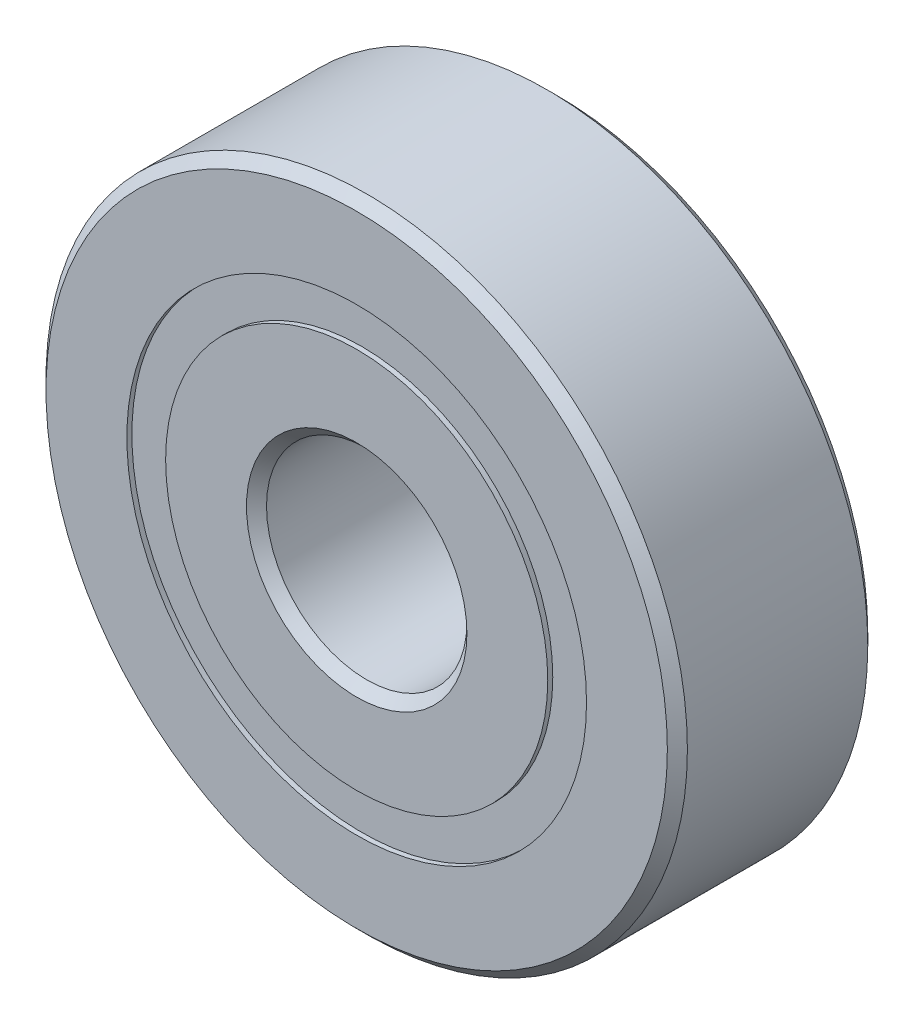
ISO-10303-21;
HEADER;
FILE_DESCRIPTION(('STEP AP214'),'2;1');
FILE_NAME('part.step','',(''),(''),'','','');
FILE_SCHEMA(('AUTOMOTIVE_DESIGN { 1 0 10303 214 1 1 1 1 }'));
ENDSEC;
DATA;
#1=APPLICATION_CONTEXT('core data for automotive mechanical design processes');
#2=APPLICATION_PROTOCOL_DEFINITION('international standard','automotive_design',2000,#1);
#3=PRODUCT_CONTEXT('',#1,'mechanical');
#4=PRODUCT('Part','Part','',(#3));
#5=PRODUCT_RELATED_PRODUCT_CATEGORY('part','',(#4));
#6=PRODUCT_DEFINITION_FORMATION('','',#4);
#7=PRODUCT_DEFINITION_CONTEXT('part definition',#1,'design');
#8=PRODUCT_DEFINITION('design','',#6,#7);
#9=PRODUCT_DEFINITION_SHAPE('','',#8);
#10=(LENGTH_UNIT() NAMED_UNIT(*) SI_UNIT(.MILLI.,.METRE.));
#11=(NAMED_UNIT(*) PLANE_ANGLE_UNIT() SI_UNIT($,.RADIAN.));
#12=(NAMED_UNIT(*) SI_UNIT($,.STERADIAN.) SOLID_ANGLE_UNIT());
#13=UNCERTAINTY_MEASURE_WITH_UNIT(LENGTH_MEASURE(1.E-05),#10,'distance_accuracy_value','');
#14=(GEOMETRIC_REPRESENTATION_CONTEXT(3) GLOBAL_UNCERTAINTY_ASSIGNED_CONTEXT((#13)) GLOBAL_UNIT_ASSIGNED_CONTEXT((#10,
#11,#12)) REPRESENTATION_CONTEXT('',''));
#15=CARTESIAN_POINT('',(0.,0.,0.));
#16=DIRECTION('',(0.,0.,1.));
#17=DIRECTION('',(1.,0.,0.));
#18=AXIS2_PLACEMENT_3D('',#15,#16,#17);
#19=CARTESIAN_POINT('',(0.,5.73351648351649,-2.375));
#20=DIRECTION('',(0.,0.,1.));
#21=DIRECTION('',(1.,0.,0.));
#22=AXIS2_PLACEMENT_3D('',#19,#20,#21);
#23=PLANE('',#22);
#24=CARTESIAN_POINT('',(0.,0.,-2.375));
#25=DIRECTION('',(0.,0.,1.));
#26=DIRECTION('',(1.,0.,0.));
#27=AXIS2_PLACEMENT_3D('',#24,#25,#26);
#28=CIRCLE('',#27,5.73351648351649);
#29=CARTESIAN_POINT('',(5.73351648351649,0.,-2.375));
#30=VERTEX_POINT('',#29);
#31=EDGE_CURVE('E59',#30,#30,#28,.T.);
#32=ORIENTED_EDGE('',*,*,#31,.F.);
#33=EDGE_LOOP('',(#32));
#34=FACE_BOUND('',#33,.T.);
#35=CARTESIAN_POINT('',(0.,0.,-2.375));
#36=DIRECTION('',(0.,0.,1.));
#37=DIRECTION('',(1.,0.,0.));
#38=AXIS2_PLACEMENT_3D('',#35,#36,#37);
#39=CIRCLE('',#38,4.76648351648352);
#40=CARTESIAN_POINT('',(4.76648351648352,0.,-2.375));
#41=VERTEX_POINT('',#40);
#42=EDGE_CURVE('E11',#41,#41,#39,.T.);
#43=ORIENTED_EDGE('',*,*,#42,.T.);
#44=EDGE_LOOP('',(#43));
#45=FACE_BOUND('',#44,.T.);
#46=ADVANCED_FACE('F45',(#34,#45),#23,.F.);
#47=CARTESIAN_POINT('',(0.,0.,2.5));
#48=DIRECTION('',(0.,0.,1.));
#49=DIRECTION('',(1.,0.,0.));
#50=AXIS2_PLACEMENT_3D('',#47,#48,#49);
#51=CYLINDRICAL_SURFACE('',#50,4.76648351648352);
#52=ORIENTED_EDGE('',*,*,#42,.F.);
#53=EDGE_LOOP('',(#52));
#54=FACE_BOUND('',#53,.T.);
#55=CARTESIAN_POINT('',(0.,0.,-1.21175743903915));
#56=DIRECTION('',(0.,0.,1.));
#57=DIRECTION('',(1.,0.,0.));
#58=AXIS2_PLACEMENT_3D('',#55,#56,#57);
#59=CIRCLE('',#58,4.76648351648352);
#60=CARTESIAN_POINT('',(4.76648351648352,0.,-1.21175743903915));
#61=VERTEX_POINT('',#60);
#62=EDGE_CURVE('E51',#61,#61,#59,.T.);
#63=ORIENTED_EDGE('',*,*,#62,.T.);
#64=EDGE_LOOP('',(#63));
#65=FACE_BOUND('',#64,.T.);
#66=ADVANCED_FACE('F68',(#54,#65),#51,.F.);
#67=CARTESIAN_POINT('',(0.,5.73351648351649,-1.21175743903915));
#68=DIRECTION('',(0.,0.,-1.));
#69=DIRECTION('',(-1.,0.,0.));
#70=AXIS2_PLACEMENT_3D('',#67,#68,#69);
#71=PLANE('',#70);
#72=ORIENTED_EDGE('',*,*,#62,.F.);
#73=EDGE_LOOP('',(#72));
#74=FACE_BOUND('',#73,.T.);
#75=CARTESIAN_POINT('',(0.,0.,-1.21175743903915));
#76=DIRECTION('',(0.,0.,1.));
#77=DIRECTION('',(1.,0.,0.));
#78=AXIS2_PLACEMENT_3D('',#75,#76,#77);
#79=CIRCLE('',#78,5.73351648351649);
#80=CARTESIAN_POINT('',(5.73351648351649,0.,-1.21175743903915));
#81=VERTEX_POINT('',#80);
#82=EDGE_CURVE('E55',#81,#81,#79,.T.);
#83=ORIENTED_EDGE('',*,*,#82,.T.);
#84=EDGE_LOOP('',(#83));
#85=FACE_BOUND('',#84,.T.);
#86=ADVANCED_FACE('F72',(#74,#85),#71,.F.);
#87=CARTESIAN_POINT('',(0.,0.,2.5));
#88=DIRECTION('',(0.,0.,1.));
#89=DIRECTION('',(1.,0.,0.));
#90=AXIS2_PLACEMENT_3D('',#87,#88,#89);
#91=CYLINDRICAL_SURFACE('',#90,5.73351648351649);
#92=ORIENTED_EDGE('',*,*,#82,.F.);
#93=EDGE_LOOP('',(#92));
#94=FACE_BOUND('',#93,.T.);
#95=ORIENTED_EDGE('',*,*,#31,.T.);
#96=EDGE_LOOP('',(#95));
#97=FACE_BOUND('',#96,.T.);
#98=ADVANCED_FACE('F65',(#94,#97),#91,.T.);
#99=CLOSED_SHELL('',(#46,#66,#86,#98));
#100=MANIFOLD_SOLID_BREP('B2',#99);
#101=CARTESIAN_POINT('',(0.,5.73351648351648,2.375));
#102=DIRECTION('',(0.,0.,-1.));
#103=DIRECTION('',(-1.,0.,0.));
#104=AXIS2_PLACEMENT_3D('',#101,#102,#103);
#105=PLANE('',#104);
#106=CARTESIAN_POINT('',(0.,0.,2.375));
#107=DIRECTION('',(0.,0.,1.));
#108=DIRECTION('',(1.,0.,0.));
#109=AXIS2_PLACEMENT_3D('',#106,#107,#108);
#110=CIRCLE('',#109,4.76648351648352);
#111=CARTESIAN_POINT('',(4.76648351648352,0.,2.375));
#112=VERTEX_POINT('',#111);
#113=EDGE_CURVE('E44',#112,#112,#110,.T.);
#114=ORIENTED_EDGE('',*,*,#113,.F.);
#115=EDGE_LOOP('',(#114));
#116=FACE_BOUND('',#115,.T.);
#117=CARTESIAN_POINT('',(0.,0.,2.375));
#118=DIRECTION('',(0.,0.,1.));
#119=DIRECTION('',(1.,0.,0.));
#120=AXIS2_PLACEMENT_3D('',#117,#118,#119);
#121=CIRCLE('',#120,5.73351648351648);
#122=CARTESIAN_POINT('',(5.73351648351648,0.,2.375));
#123=VERTEX_POINT('',#122);
#124=EDGE_CURVE('E126',#123,#123,#121,.T.);
#125=ORIENTED_EDGE('',*,*,#124,.T.);
#126=EDGE_LOOP('',(#125));
#127=FACE_BOUND('',#126,.T.);
#128=ADVANCED_FACE('F112',(#116,#127),#105,.F.);
#129=CARTESIAN_POINT('',(0.,0.,2.5));
#130=DIRECTION('',(0.,0.,1.));
#131=DIRECTION('',(1.,0.,0.));
#132=AXIS2_PLACEMENT_3D('',#129,#130,#131);
#133=CYLINDRICAL_SURFACE('',#132,4.76648351648352);
#134=CARTESIAN_POINT('',(0.,0.,1.21175743903915));
#135=DIRECTION('',(0.,0.,1.));
#136=DIRECTION('',(1.,0.,0.));
#137=AXIS2_PLACEMENT_3D('',#134,#135,#136);
#138=CIRCLE('',#137,4.76648351648352);
#139=CARTESIAN_POINT('',(4.76648351648352,0.,1.21175743903915));
#140=VERTEX_POINT('',#139);
#141=EDGE_CURVE('E118',#140,#140,#138,.T.);
#142=ORIENTED_EDGE('',*,*,#141,.F.);
#143=EDGE_LOOP('',(#142));
#144=FACE_BOUND('',#143,.T.);
#145=ORIENTED_EDGE('',*,*,#113,.T.);
#146=EDGE_LOOP('',(#145));
#147=FACE_BOUND('',#146,.T.);
#148=ADVANCED_FACE('F141',(#144,#147),#133,.F.);
#149=CARTESIAN_POINT('',(0.,5.73351648351648,1.21175743903915));
#150=DIRECTION('',(0.,0.,1.));
#151=DIRECTION('',(1.,0.,0.));
#152=AXIS2_PLACEMENT_3D('',#149,#150,#151);
#153=PLANE('',#152);
#154=CARTESIAN_POINT('',(0.,0.,1.21175743903915));
#155=DIRECTION('',(0.,0.,1.));
#156=DIRECTION('',(1.,0.,0.));
#157=AXIS2_PLACEMENT_3D('',#154,#155,#156);
#158=CIRCLE('',#157,5.73351648351648);
#159=CARTESIAN_POINT('',(5.73351648351648,0.,1.21175743903915));
#160=VERTEX_POINT('',#159);
#161=EDGE_CURVE('E122',#160,#160,#158,.T.);
#162=ORIENTED_EDGE('',*,*,#161,.F.);
#163=EDGE_LOOP('',(#162));
#164=FACE_BOUND('',#163,.T.);
#165=ORIENTED_EDGE('',*,*,#141,.T.);
#166=EDGE_LOOP('',(#165));
#167=FACE_BOUND('',#166,.T.);
#168=ADVANCED_FACE('F136',(#164,#167),#153,.F.);
#169=CARTESIAN_POINT('',(0.,0.,2.5));
#170=DIRECTION('',(0.,0.,1.));
#171=DIRECTION('',(1.,0.,0.));
#172=AXIS2_PLACEMENT_3D('',#169,#170,#171);
#173=CYLINDRICAL_SURFACE('',#172,5.73351648351648);
#174=ORIENTED_EDGE('',*,*,#124,.F.);
#175=EDGE_LOOP('',(#174));
#176=FACE_BOUND('',#175,.T.);
#177=ORIENTED_EDGE('',*,*,#161,.T.);
#178=EDGE_LOOP('',(#177));
#179=FACE_BOUND('',#178,.T.);
#180=ADVANCED_FACE('F133',(#176,#179),#173,.T.);
#181=CLOSED_SHELL('',(#128,#148,#168,#180));
#182=MANIFOLD_SOLID_BREP('B6',#181);
#183=CARTESIAN_POINT('',(-2.62499999999994,4.54663336986834,0.));
#184=DIRECTION('',(0.,0.,1.));
#185=DIRECTION('',(-0.499999999999989,0.866025403784445,0.));
#186=AXIS2_PLACEMENT_3D('',#183,#184,#185);
#187=SPHERICAL_SURFACE('',#186,1.21175743903915);
#188=CARTESIAN_POINT('',(-2.62499999999994,4.54663336986834,1.21175743903915));
#189=VERTEX_POINT('',#188);
#190=VERTEX_LOOP('',#189);
#191=FACE_BOUND('',#190,.T.);
#192=ADVANCED_FACE('F179',(#191),#187,.T.);
#193=CLOSED_SHELL('',(#192));
#194=MANIFOLD_SOLID_BREP('B39',#193);
#195=CARTESIAN_POINT('',(-4.54663336986827,2.62500000000005,0.));
#196=DIRECTION('',(0.,0.,1.));
#197=DIRECTION('',(-0.866025403784433,0.50000000000001,0.));
#198=AXIS2_PLACEMENT_3D('',#195,#196,#197);
#199=SPHERICAL_SURFACE('',#198,1.21175743903915);
#200=CARTESIAN_POINT('',(-4.54663336986827,2.62500000000005,1.21175743903915));
#201=VERTEX_POINT('',#200);
#202=VERTEX_LOOP('',#201);
#203=FACE_BOUND('',#202,.T.);
#204=ADVANCED_FACE('F199',(#203),#199,.T.);
#205=CLOSED_SHELL('',(#204));
#206=MANIFOLD_SOLID_BREP('B108',#205);
#207=CARTESIAN_POINT('',(-5.25,0.,0.));
#208=DIRECTION('',(0.,0.,1.));
#209=DIRECTION('',(-1.,0.,0.));
#210=AXIS2_PLACEMENT_3D('',#207,#208,#209);
#211=SPHERICAL_SURFACE('',#210,1.21175743903915);
#212=CARTESIAN_POINT('',(-5.25,0.,1.21175743903915));
#213=VERTEX_POINT('',#212);
#214=VERTEX_LOOP('',#213);
#215=FACE_BOUND('',#214,.T.);
#216=ADVANCED_FACE('F219',(#215),#211,.T.);
#217=CLOSED_SHELL('',(#216));
#218=MANIFOLD_SOLID_BREP('B175',#217);
#219=CARTESIAN_POINT('',(-4.54663336986833,-2.62499999999996,0.));
#220=DIRECTION('',(0.,0.,1.));
#221=DIRECTION('',(-0.866025403784443,-0.499999999999992,0.));
#222=AXIS2_PLACEMENT_3D('',#219,#220,#221);
#223=SPHERICAL_SURFACE('',#222,1.21175743903915);
#224=CARTESIAN_POINT('',(-4.54663336986833,-2.62499999999996,1.21175743903915));
#225=VERTEX_POINT('',#224);
#226=VERTEX_LOOP('',#225);
#227=FACE_BOUND('',#226,.T.);
#228=ADVANCED_FACE('F239',(#227),#223,.T.);
#229=CLOSED_SHELL('',(#228));
#230=MANIFOLD_SOLID_BREP('B195',#229);
#231=CARTESIAN_POINT('',(-2.62500000000004,-4.54663336986828,0.));
#232=DIRECTION('',(0.,0.,1.));
#233=DIRECTION('',(-0.500000000000007,-0.866025403784435,0.));
#234=AXIS2_PLACEMENT_3D('',#231,#232,#233);
#235=SPHERICAL_SURFACE('',#234,1.21175743903915);
#236=CARTESIAN_POINT('',(-2.62500000000004,-4.54663336986828,1.21175743903915));
#237=VERTEX_POINT('',#236);
#238=VERTEX_LOOP('',#237);
#239=FACE_BOUND('',#238,.T.);
#240=ADVANCED_FACE('F259',(#239),#235,.T.);
#241=CLOSED_SHELL('',(#240));
#242=MANIFOLD_SOLID_BREP('B215',#241);
#243=CARTESIAN_POINT('',(0.,-5.25,0.));
#244=DIRECTION('',(0.,0.,1.));
#245=DIRECTION('',(0.,-1.,0.));
#246=AXIS2_PLACEMENT_3D('',#243,#244,#245);
#247=SPHERICAL_SURFACE('',#246,1.21175743903915);
#248=CARTESIAN_POINT('',(0.,-5.25,1.21175743903915));
#249=VERTEX_POINT('',#248);
#250=VERTEX_LOOP('',#249);
#251=FACE_BOUND('',#250,.T.);
#252=ADVANCED_FACE('F279',(#251),#247,.T.);
#253=CLOSED_SHELL('',(#252));
#254=MANIFOLD_SOLID_BREP('B235',#253);
#255=CARTESIAN_POINT('',(2.62499999999997,-4.54663336986832,0.));
#256=DIRECTION('',(0.,0.,1.));
#257=DIRECTION('',(0.499999999999995,-0.866025403784442,0.));
#258=AXIS2_PLACEMENT_3D('',#255,#256,#257);
#259=SPHERICAL_SURFACE('',#258,1.21175743903915);
#260=CARTESIAN_POINT('',(2.62499999999997,-4.54663336986832,1.21175743903915));
#261=VERTEX_POINT('',#260);
#262=VERTEX_LOOP('',#261);
#263=FACE_BOUND('',#262,.T.);
#264=ADVANCED_FACE('F299',(#263),#259,.T.);
#265=CLOSED_SHELL('',(#264));
#266=MANIFOLD_SOLID_BREP('B255',#265);
#267=CARTESIAN_POINT('',(4.54663336986829,-2.62500000000002,0.));
#268=DIRECTION('',(0.,0.,1.));
#269=DIRECTION('',(0.866025403784436,-0.500000000000004,0.));
#270=AXIS2_PLACEMENT_3D('',#267,#268,#269);
#271=SPHERICAL_SURFACE('',#270,1.21175743903915);
#272=CARTESIAN_POINT('',(4.54663336986829,-2.62500000000002,1.21175743903915));
#273=VERTEX_POINT('',#272);
#274=VERTEX_LOOP('',#273);
#275=FACE_BOUND('',#274,.T.);
#276=ADVANCED_FACE('F319',(#275),#271,.T.);
#277=CLOSED_SHELL('',(#276));
#278=MANIFOLD_SOLID_BREP('B275',#277);
#279=CARTESIAN_POINT('',(5.25,0.,0.));
#280=DIRECTION('',(0.,0.,1.));
#281=DIRECTION('',(1.,0.,0.));
#282=AXIS2_PLACEMENT_3D('',#279,#280,#281);
#283=SPHERICAL_SURFACE('',#282,1.21175743903915);
#284=CARTESIAN_POINT('',(5.25,0.,1.21175743903915));
#285=VERTEX_POINT('',#284);
#286=VERTEX_LOOP('',#285);
#287=FACE_BOUND('',#286,.T.);
#288=ADVANCED_FACE('F339',(#287),#283,.T.);
#289=CLOSED_SHELL('',(#288));
#290=MANIFOLD_SOLID_BREP('B295',#289);
#291=CARTESIAN_POINT('',(4.54663336986831,2.62499999999999,0.));
#292=DIRECTION('',(0.,0.,1.));
#293=DIRECTION('',(0.86602540378444,0.499999999999998,0.));
#294=AXIS2_PLACEMENT_3D('',#291,#292,#293);
#295=SPHERICAL_SURFACE('',#294,1.21175743903915);
#296=CARTESIAN_POINT('',(4.54663336986831,2.62499999999999,1.21175743903915));
#297=VERTEX_POINT('',#296);
#298=VERTEX_LOOP('',#297);
#299=FACE_BOUND('',#298,.T.);
#300=ADVANCED_FACE('F359',(#299),#295,.T.);
#301=CLOSED_SHELL('',(#300));
#302=MANIFOLD_SOLID_BREP('B315',#301);
#303=CARTESIAN_POINT('',(2.62500000000001,4.5466333698683,0.));
#304=DIRECTION('',(0.,0.,1.));
#305=DIRECTION('',(0.500000000000001,0.866025403784438,0.));
#306=AXIS2_PLACEMENT_3D('',#303,#304,#305);
#307=SPHERICAL_SURFACE('',#306,1.21175743903915);
#308=CARTESIAN_POINT('',(2.62500000000001,4.5466333698683,1.21175743903915));
#309=VERTEX_POINT('',#308);
#310=VERTEX_LOOP('',#309);
#311=FACE_BOUND('',#310,.T.);
#312=ADVANCED_FACE('F379',(#311),#307,.T.);
#313=CLOSED_SHELL('',(#312));
#314=MANIFOLD_SOLID_BREP('B335',#313);
#315=CARTESIAN_POINT('',(0.,5.25,0.));
#316=DIRECTION('',(0.,0.,1.));
#317=DIRECTION('',(0.,1.,0.));
#318=AXIS2_PLACEMENT_3D('',#315,#316,#317);
#319=SPHERICAL_SURFACE('',#318,1.21175743903915);
#320=CARTESIAN_POINT('',(0.,5.25,1.21175743903915));
#321=VERTEX_POINT('',#320);
#322=VERTEX_LOOP('',#321);
#323=FACE_BOUND('',#322,.T.);
#324=ADVANCED_FACE('F401',(#323),#319,.T.);
#325=CLOSED_SHELL('',(#324));
#326=MANIFOLD_SOLID_BREP('B355',#325);
#327=CARTESIAN_POINT('',(0.,4.76648351648352,2.5));
#328=DIRECTION('',(0.,0.,-1.));
#329=DIRECTION('',(-1.,0.,0.));
#330=AXIS2_PLACEMENT_3D('',#327,#328,#329);
#331=PLANE('',#330);
#332=CARTESIAN_POINT('',(0.,0.,2.5));
#333=DIRECTION('',(0.,0.,1.));
#334=DIRECTION('',(1.,0.,0.));
#335=AXIS2_PLACEMENT_3D('',#332,#333,#334);
#336=CIRCLE('',#335,2.75);
#337=CARTESIAN_POINT('',(2.75,0.,2.5));
#338=VERTEX_POINT('',#337);
#339=EDGE_CURVE('E448',#338,#338,#336,.T.);
#340=ORIENTED_EDGE('',*,*,#339,.F.);
#341=EDGE_LOOP('',(#340));
#342=FACE_BOUND('',#341,.T.);
#343=CARTESIAN_POINT('',(0.,0.,2.5));
#344=DIRECTION('',(0.,0.,1.));
#345=DIRECTION('',(1.,0.,0.));
#346=AXIS2_PLACEMENT_3D('',#343,#344,#345);
#347=CIRCLE('',#346,4.76648351648352);
#348=CARTESIAN_POINT('',(4.76648351648352,0.,2.5));
#349=VERTEX_POINT('',#348);
#350=EDGE_CURVE('E400',#349,#349,#347,.T.);
#351=ORIENTED_EDGE('',*,*,#350,.T.);
#352=EDGE_LOOP('',(#351));
#353=FACE_BOUND('',#352,.T.);
#354=ADVANCED_FACE('F420',(#342,#353),#331,.F.);
#355=CARTESIAN_POINT('',(0.,0.,2.5));
#356=DIRECTION('',(0.,0.,1.));
#357=DIRECTION('',(1.,0.,0.));
#358=AXIS2_PLACEMENT_3D('',#355,#356,#357);
#359=CYLINDRICAL_SURFACE('',#358,4.76648351648352);
#360=ORIENTED_EDGE('',*,*,#350,.F.);
#361=EDGE_LOOP('',(#360));
#362=FACE_BOUND('',#361,.T.);
#363=CARTESIAN_POINT('',(0.,0.,1.11111111111111));
#364=DIRECTION('',(0.,0.,1.));
#365=DIRECTION('',(1.,0.,0.));
#366=AXIS2_PLACEMENT_3D('',#363,#364,#365);
#367=CIRCLE('',#366,4.76648351648352);
#368=CARTESIAN_POINT('',(4.76648351648352,0.,1.11111111111111));
#369=VERTEX_POINT('',#368);
#370=EDGE_CURVE('E426',#369,#369,#367,.T.);
#371=ORIENTED_EDGE('',*,*,#370,.T.);
#372=EDGE_LOOP('',(#371));
#373=FACE_BOUND('',#372,.T.);
#374=ADVANCED_FACE('F455',(#362,#373),#359,.T.);
#375=CARTESIAN_POINT('',(0.,0.,0.));
#376=DIRECTION('',(0.,0.,1.));
#377=DIRECTION('',(1.,0.,0.));
#378=AXIS2_PLACEMENT_3D('',#375,#376,#377);
#379=TOROIDAL_SURFACE('',#378,5.25,1.21175743903915);
#380=ORIENTED_EDGE('',*,*,#370,.F.);
#381=EDGE_LOOP('',(#380));
#382=FACE_BOUND('',#381,.T.);
#383=CARTESIAN_POINT('',(0.,0.,-1.11111111111111));
#384=DIRECTION('',(0.,0.,1.));
#385=DIRECTION('',(1.,0.,0.));
#386=AXIS2_PLACEMENT_3D('',#383,#384,#385);
#387=CIRCLE('',#386,4.76648351648352);
#388=CARTESIAN_POINT('',(4.76648351648352,0.,-1.11111111111111));
#389=VERTEX_POINT('',#388);
#390=EDGE_CURVE('E430',#389,#389,#387,.T.);
#391=ORIENTED_EDGE('',*,*,#390,.T.);
#392=EDGE_LOOP('',(#391));
#393=FACE_BOUND('',#392,.T.);
#394=ADVANCED_FACE('F459',(#382,#393),#379,.F.);
#395=CARTESIAN_POINT('',(0.,0.,2.5));
#396=DIRECTION('',(0.,0.,1.));
#397=DIRECTION('',(1.,0.,0.));
#398=AXIS2_PLACEMENT_3D('',#395,#396,#397);
#399=CYLINDRICAL_SURFACE('',#398,4.76648351648352);
#400=ORIENTED_EDGE('',*,*,#390,.F.);
#401=EDGE_LOOP('',(#400));
#402=FACE_BOUND('',#401,.T.);
#403=CARTESIAN_POINT('',(0.,0.,-2.5));
#404=DIRECTION('',(0.,0.,1.));
#405=DIRECTION('',(1.,0.,0.));
#406=AXIS2_PLACEMENT_3D('',#403,#404,#405);
#407=CIRCLE('',#406,4.76648351648352);
#408=CARTESIAN_POINT('',(4.76648351648352,0.,-2.5));
#409=VERTEX_POINT('',#408);
#410=EDGE_CURVE('E434',#409,#409,#407,.T.);
#411=ORIENTED_EDGE('',*,*,#410,.T.);
#412=EDGE_LOOP('',(#411));
#413=FACE_BOUND('',#412,.T.);
#414=ADVANCED_FACE('F464',(#402,#413),#399,.T.);
#415=CARTESIAN_POINT('',(0.,2.75,-2.5));
#416=DIRECTION('',(0.,0.,1.));
#417=DIRECTION('',(1.,0.,0.));
#418=AXIS2_PLACEMENT_3D('',#415,#416,#417);
#419=PLANE('',#418);
#420=ORIENTED_EDGE('',*,*,#410,.F.);
#421=EDGE_LOOP('',(#420));
#422=FACE_BOUND('',#421,.T.);
#423=CARTESIAN_POINT('',(0.,0.,-2.5));
#424=DIRECTION('',(0.,0.,1.));
#425=DIRECTION('',(1.,0.,0.));
#426=AXIS2_PLACEMENT_3D('',#423,#424,#425);
#427=CIRCLE('',#426,2.75);
#428=CARTESIAN_POINT('',(2.75,0.,-2.5));
#429=VERTEX_POINT('',#428);
#430=EDGE_CURVE('E439',#429,#429,#427,.T.);
#431=ORIENTED_EDGE('',*,*,#430,.T.);
#432=EDGE_LOOP('',(#431));
#433=FACE_BOUND('',#432,.T.);
#434=ADVANCED_FACE('F470',(#422,#433),#419,.F.);
#435=CARTESIAN_POINT('',(0.,0.,-2.25));
#436=DIRECTION('',(0.,0.,-1.));
#437=DIRECTION('',(-1.,0.,0.));
#438=AXIS2_PLACEMENT_3D('',#435,#436,#437);
#439=CONICAL_SURFACE('',#438,2.5,0.785398163397447);
#440=ORIENTED_EDGE('',*,*,#430,.F.);
#441=EDGE_LOOP('',(#440));
#442=FACE_BOUND('',#441,.T.);
#443=CARTESIAN_POINT('',(0.,0.,-2.25));
#444=DIRECTION('',(0.,0.,1.));
#445=DIRECTION('',(1.,0.,0.));
#446=AXIS2_PLACEMENT_3D('',#443,#444,#445);
#447=CIRCLE('',#446,2.5);
#448=CARTESIAN_POINT('',(2.5,0.,-2.25));
#449=VERTEX_POINT('',#448);
#450=EDGE_CURVE('E442',#449,#449,#447,.T.);
#451=ORIENTED_EDGE('',*,*,#450,.T.);
#452=EDGE_LOOP('',(#451));
#453=FACE_BOUND('',#452,.T.);
#454=ADVANCED_FACE('F474',(#442,#453),#439,.F.);
#455=CARTESIAN_POINT('',(0.,0.,2.5));
#456=DIRECTION('',(0.,0.,1.));
#457=DIRECTION('',(1.,0.,0.));
#458=AXIS2_PLACEMENT_3D('',#455,#456,#457);
#459=CYLINDRICAL_SURFACE('',#458,2.5);
#460=ORIENTED_EDGE('',*,*,#450,.F.);
#461=EDGE_LOOP('',(#460));
#462=FACE_BOUND('',#461,.T.);
#463=CARTESIAN_POINT('',(0.,0.,2.25));
#464=DIRECTION('',(0.,0.,1.));
#465=DIRECTION('',(1.,0.,0.));
#466=AXIS2_PLACEMENT_3D('',#463,#464,#465);
#467=CIRCLE('',#466,2.5);
#468=CARTESIAN_POINT('',(2.5,0.,2.25));
#469=VERTEX_POINT('',#468);
#470=EDGE_CURVE('E445',#469,#469,#467,.T.);
#471=ORIENTED_EDGE('',*,*,#470,.T.);
#472=EDGE_LOOP('',(#471));
#473=FACE_BOUND('',#472,.T.);
#474=ADVANCED_FACE('F478',(#462,#473),#459,.F.);
#475=CARTESIAN_POINT('',(0.,0.,2.5));
#476=DIRECTION('',(0.,0.,1.));
#477=DIRECTION('',(1.,0.,0.));
#478=AXIS2_PLACEMENT_3D('',#475,#476,#477);
#479=CONICAL_SURFACE('',#478,2.75,0.785398163397452);
#480=ORIENTED_EDGE('',*,*,#470,.F.);
#481=EDGE_LOOP('',(#480));
#482=FACE_BOUND('',#481,.T.);
#483=ORIENTED_EDGE('',*,*,#339,.T.);
#484=EDGE_LOOP('',(#483));
#485=FACE_BOUND('',#484,.T.);
#486=ADVANCED_FACE('F452',(#482,#485),#479,.F.);
#487=CLOSED_SHELL('',(#354,#374,#394,#414,#434,#454,#474,#486));
#488=MANIFOLD_SOLID_BREP('B375',#487);
#489=CARTESIAN_POINT('',(0.,0.,2.25));
#490=DIRECTION('',(0.,0.,-1.));
#491=DIRECTION('',(-1.,0.,0.));
#492=AXIS2_PLACEMENT_3D('',#489,#490,#491);
#493=CONICAL_SURFACE('',#492,8.,0.785398163397448);
#494=CARTESIAN_POINT('',(0.,0.,2.5));
#495=DIRECTION('',(0.,0.,1.));
#496=DIRECTION('',(1.,0.,0.));
#497=AXIS2_PLACEMENT_3D('',#494,#495,#496);
#498=CIRCLE('',#497,7.75);
#499=CARTESIAN_POINT('',(7.75,0.,2.5));
#500=VERTEX_POINT('',#499);
#501=EDGE_CURVE('E569',#500,#500,#498,.T.);
#502=ORIENTED_EDGE('',*,*,#501,.F.);
#503=EDGE_LOOP('',(#502));
#504=FACE_BOUND('',#503,.T.);
#505=CARTESIAN_POINT('',(0.,0.,2.25));
#506=DIRECTION('',(0.,0.,1.));
#507=DIRECTION('',(1.,0.,0.));
#508=AXIS2_PLACEMENT_3D('',#505,#506,#507);
#509=CIRCLE('',#508,8.);
#510=CARTESIAN_POINT('',(8.,0.,2.25));
#511=VERTEX_POINT('',#510);
#512=EDGE_CURVE('E419',#511,#511,#509,.T.);
#513=ORIENTED_EDGE('',*,*,#512,.T.);
#514=EDGE_LOOP('',(#513));
#515=FACE_BOUND('',#514,.T.);
#516=ADVANCED_FACE('F541',(#504,#515),#493,.T.);
#517=CARTESIAN_POINT('',(0.,0.,2.5));
#518=DIRECTION('',(0.,0.,1.));
#519=DIRECTION('',(1.,0.,0.));
#520=AXIS2_PLACEMENT_3D('',#517,#518,#519);
#521=CYLINDRICAL_SURFACE('',#520,8.);
#522=ORIENTED_EDGE('',*,*,#512,.F.);
#523=EDGE_LOOP('',(#522));
#524=FACE_BOUND('',#523,.T.);
#525=CARTESIAN_POINT('',(0.,0.,-2.25));
#526=DIRECTION('',(0.,0.,1.));
#527=DIRECTION('',(1.,0.,0.));
#528=AXIS2_PLACEMENT_3D('',#525,#526,#527);
#529=CIRCLE('',#528,8.);
#530=CARTESIAN_POINT('',(8.,0.,-2.25));
#531=VERTEX_POINT('',#530);
#532=EDGE_CURVE('E547',#531,#531,#529,.T.);
#533=ORIENTED_EDGE('',*,*,#532,.T.);
#534=EDGE_LOOP('',(#533));
#535=FACE_BOUND('',#534,.T.);
#536=ADVANCED_FACE('F576',(#524,#535),#521,.T.);
#537=CARTESIAN_POINT('',(0.,0.,-2.5));
#538=DIRECTION('',(0.,0.,1.));
#539=DIRECTION('',(1.,0.,0.));
#540=AXIS2_PLACEMENT_3D('',#537,#538,#539);
#541=CONICAL_SURFACE('',#540,7.75,0.785398163397447);
#542=ORIENTED_EDGE('',*,*,#532,.F.);
#543=EDGE_LOOP('',(#542));
#544=FACE_BOUND('',#543,.T.);
#545=CARTESIAN_POINT('',(0.,0.,-2.5));
#546=DIRECTION('',(0.,0.,1.));
#547=DIRECTION('',(1.,0.,0.));
#548=AXIS2_PLACEMENT_3D('',#545,#546,#547);
#549=CIRCLE('',#548,7.75);
#550=CARTESIAN_POINT('',(7.75,0.,-2.5));
#551=VERTEX_POINT('',#550);
#552=EDGE_CURVE('E551',#551,#551,#549,.T.);
#553=ORIENTED_EDGE('',*,*,#552,.T.);
#554=EDGE_LOOP('',(#553));
#555=FACE_BOUND('',#554,.T.);
#556=ADVANCED_FACE('F580',(#544,#555),#541,.T.);
#557=CARTESIAN_POINT('',(0.,7.75,-2.5));
#558=DIRECTION('',(0.,0.,1.));
#559=DIRECTION('',(1.,0.,0.));
#560=AXIS2_PLACEMENT_3D('',#557,#558,#559);
#561=PLANE('',#560);
#562=ORIENTED_EDGE('',*,*,#552,.F.);
#563=EDGE_LOOP('',(#562));
#564=FACE_BOUND('',#563,.T.);
#565=CARTESIAN_POINT('',(0.,0.,-2.5));
#566=DIRECTION('',(0.,0.,1.));
#567=DIRECTION('',(1.,0.,0.));
#568=AXIS2_PLACEMENT_3D('',#565,#566,#567);
#569=CIRCLE('',#568,5.73351648351649);
#570=CARTESIAN_POINT('',(5.73351648351649,0.,-2.5));
#571=VERTEX_POINT('',#570);
#572=EDGE_CURVE('E555',#571,#571,#569,.T.);
#573=ORIENTED_EDGE('',*,*,#572,.T.);
#574=EDGE_LOOP('',(#573));
#575=FACE_BOUND('',#574,.T.);
#576=ADVANCED_FACE('F585',(#564,#575),#561,.F.);
#577=CARTESIAN_POINT('',(0.,0.,2.5));
#578=DIRECTION('',(0.,0.,1.));
#579=DIRECTION('',(1.,0.,0.));
#580=AXIS2_PLACEMENT_3D('',#577,#578,#579);
#581=CYLINDRICAL_SURFACE('',#580,5.73351648351648);
#582=ORIENTED_EDGE('',*,*,#572,.F.);
#583=EDGE_LOOP('',(#582));
#584=FACE_BOUND('',#583,.T.);
#585=CARTESIAN_POINT('',(0.,0.,-1.11111111111111));
#586=DIRECTION('',(0.,0.,1.));
#587=DIRECTION('',(1.,0.,0.));
#588=AXIS2_PLACEMENT_3D('',#585,#586,#587);
#589=CIRCLE('',#588,5.73351648351648);
#590=CARTESIAN_POINT('',(5.73351648351648,0.,-1.11111111111111));
#591=VERTEX_POINT('',#590);
#592=EDGE_CURVE('E560',#591,#591,#589,.T.);
#593=ORIENTED_EDGE('',*,*,#592,.T.);
#594=EDGE_LOOP('',(#593));
#595=FACE_BOUND('',#594,.T.);
#596=ADVANCED_FACE('F591',(#584,#595),#581,.F.);
#597=CARTESIAN_POINT('',(0.,0.,0.));
#598=DIRECTION('',(0.,0.,1.));
#599=DIRECTION('',(1.,0.,0.));
#600=AXIS2_PLACEMENT_3D('',#597,#598,#599);
#601=TOROIDAL_SURFACE('',#600,5.25,1.21175743903915);
#602=ORIENTED_EDGE('',*,*,#592,.F.);
#603=EDGE_LOOP('',(#602));
#604=FACE_BOUND('',#603,.T.);
#605=CARTESIAN_POINT('',(0.,0.,1.11111111111111));
#606=DIRECTION('',(0.,0.,1.));
#607=DIRECTION('',(1.,0.,0.));
#608=AXIS2_PLACEMENT_3D('',#605,#606,#607);
#609=CIRCLE('',#608,5.73351648351648);
#610=CARTESIAN_POINT('',(5.73351648351648,0.,1.11111111111111));
#611=VERTEX_POINT('',#610);
#612=EDGE_CURVE('E563',#611,#611,#609,.T.);
#613=ORIENTED_EDGE('',*,*,#612,.T.);
#614=EDGE_LOOP('',(#613));
#615=FACE_BOUND('',#614,.T.);
#616=ADVANCED_FACE('F595',(#604,#615),#601,.F.);
#617=CARTESIAN_POINT('',(0.,0.,2.5));
#618=DIRECTION('',(0.,0.,1.));
#619=DIRECTION('',(1.,0.,0.));
#620=AXIS2_PLACEMENT_3D('',#617,#618,#619);
#621=CYLINDRICAL_SURFACE('',#620,5.73351648351648);
#622=ORIENTED_EDGE('',*,*,#612,.F.);
#623=EDGE_LOOP('',(#622));
#624=FACE_BOUND('',#623,.T.);
#625=CARTESIAN_POINT('',(0.,0.,2.5));
#626=DIRECTION('',(0.,0.,1.));
#627=DIRECTION('',(1.,0.,0.));
#628=AXIS2_PLACEMENT_3D('',#625,#626,#627);
#629=CIRCLE('',#628,5.73351648351648);
#630=CARTESIAN_POINT('',(5.73351648351648,0.,2.5));
#631=VERTEX_POINT('',#630);
#632=EDGE_CURVE('E566',#631,#631,#629,.T.);
#633=ORIENTED_EDGE('',*,*,#632,.T.);
#634=EDGE_LOOP('',(#633));
#635=FACE_BOUND('',#634,.T.);
#636=ADVANCED_FACE('F599',(#624,#635),#621,.F.);
#637=CARTESIAN_POINT('',(0.,7.75,2.5));
#638=DIRECTION('',(0.,0.,-1.));
#639=DIRECTION('',(-1.,0.,0.));
#640=AXIS2_PLACEMENT_3D('',#637,#638,#639);
#641=PLANE('',#640);
#642=ORIENTED_EDGE('',*,*,#632,.F.);
#643=EDGE_LOOP('',(#642));
#644=FACE_BOUND('',#643,.T.);
#645=ORIENTED_EDGE('',*,*,#501,.T.);
#646=EDGE_LOOP('',(#645));
#647=FACE_BOUND('',#646,.T.);
#648=ADVANCED_FACE('F573',(#644,#647),#641,.F.);
#649=CLOSED_SHELL('',(#516,#536,#556,#576,#596,#616,#636,#648));
#650=MANIFOLD_SOLID_BREP('B395',#649);
#651=ADVANCED_BREP_SHAPE_REPRESENTATION('',(#18,#100,#182,#194,#206,#218,#230,#242,#254,#266,
#278,#290,#302,#314,#326,#488,#650),#14);
#652=SHAPE_DEFINITION_REPRESENTATION(#9,#651);
ENDSEC;
END-ISO-10303-21;
